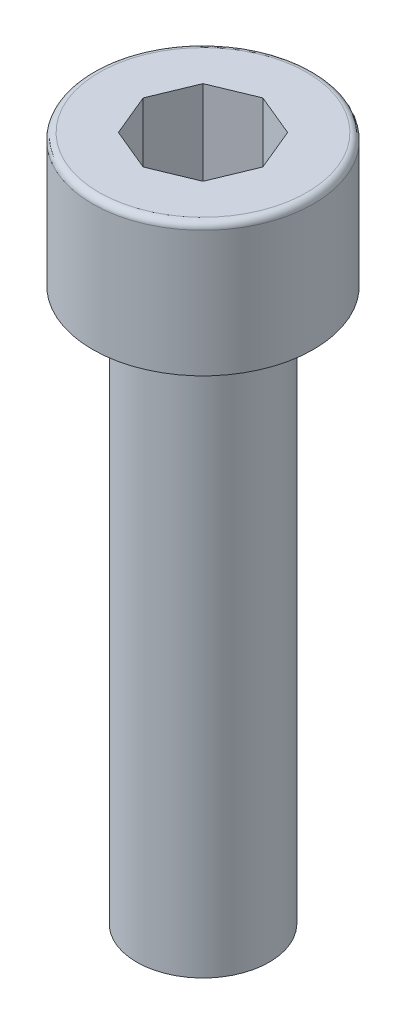
ISO-10303-21;
HEADER;
FILE_DESCRIPTION(('STEP AP214'),'2;1');
FILE_NAME('part.step','',(''),(''),'','','');
FILE_SCHEMA(('AUTOMOTIVE_DESIGN { 1 0 10303 214 1 1 1 1 }'));
ENDSEC;
DATA;
#1=APPLICATION_CONTEXT('core data for automotive mechanical design processes');
#2=APPLICATION_PROTOCOL_DEFINITION('international standard','automotive_design',2000,#1);
#3=PRODUCT_CONTEXT('',#1,'mechanical');
#4=PRODUCT('Part','Part','',(#3));
#5=PRODUCT_RELATED_PRODUCT_CATEGORY('part','',(#4));
#6=PRODUCT_DEFINITION_FORMATION('','',#4);
#7=PRODUCT_DEFINITION_CONTEXT('part definition',#1,'design');
#8=PRODUCT_DEFINITION('design','',#6,#7);
#9=PRODUCT_DEFINITION_SHAPE('','',#8);
#10=(LENGTH_UNIT() NAMED_UNIT(*) SI_UNIT(.MILLI.,.METRE.));
#11=(NAMED_UNIT(*) PLANE_ANGLE_UNIT() SI_UNIT($,.RADIAN.));
#12=(NAMED_UNIT(*) SI_UNIT($,.STERADIAN.) SOLID_ANGLE_UNIT());
#13=UNCERTAINTY_MEASURE_WITH_UNIT(LENGTH_MEASURE(1.E-05),#10,'distance_accuracy_value','');
#14=(GEOMETRIC_REPRESENTATION_CONTEXT(3) GLOBAL_UNCERTAINTY_ASSIGNED_CONTEXT((#13)) GLOBAL_UNIT_ASSIGNED_CONTEXT((#10,
#11,#12)) REPRESENTATION_CONTEXT('',''));
#15=CARTESIAN_POINT('',(0.,0.,0.));
#16=DIRECTION('',(0.,0.,1.));
#17=DIRECTION('',(1.,0.,0.));
#18=AXIS2_PLACEMENT_3D('',#15,#16,#17);
#19=CARTESIAN_POINT('',(0.,25.,0.));
#20=DIRECTION('',(0.,-1.,0.));
#21=DIRECTION('',(0.,0.,-1.));
#22=AXIS2_PLACEMENT_3D('',#19,#20,#21);
#23=CYLINDRICAL_SURFACE('',#22,3.);
#24=CARTESIAN_POINT('',(0.,24.75,0.));
#25=DIRECTION('',(0.,1.,0.));
#26=DIRECTION('',(0.,0.,1.));
#27=AXIS2_PLACEMENT_3D('',#24,#25,#26);
#28=CIRCLE('',#27,3.);
#29=CARTESIAN_POINT('',(0.,24.75,3.));
#30=VERTEX_POINT('',#29);
#31=EDGE_CURVE('E11',#30,#30,#28,.F.);
#32=ORIENTED_EDGE('',*,*,#31,.T.);
#33=EDGE_LOOP('',(#32));
#34=FACE_BOUND('',#33,.T.);
#35=CARTESIAN_POINT('',(0.,0.,0.));
#36=DIRECTION('',(0.,1.,0.));
#37=DIRECTION('',(0.,0.,1.));
#38=AXIS2_PLACEMENT_3D('',#35,#36,#37);
#39=CIRCLE('',#38,3.);
#40=CARTESIAN_POINT('',(0.,0.,3.));
#41=VERTEX_POINT('',#40);
#42=EDGE_CURVE('E110',#41,#41,#39,.T.);
#43=ORIENTED_EDGE('',*,*,#42,.T.);
#44=EDGE_LOOP('',(#43));
#45=FACE_BOUND('',#44,.T.);
#46=ADVANCED_FACE('F37',(#34,#45),#23,.T.);
#47=CARTESIAN_POINT('',(0.,0.,0.));
#48=DIRECTION('',(0.,1.,0.));
#49=DIRECTION('',(0.,0.,1.));
#50=AXIS2_PLACEMENT_3D('',#47,#48,#49);
#51=PLANE('',#50);
#52=ORIENTED_EDGE('',*,*,#42,.F.);
#53=EDGE_LOOP('',(#52));
#54=FACE_BOUND('',#53,.T.);
#55=ADVANCED_FACE('F198',(#54),#51,.F.);
#56=CARTESIAN_POINT('',(2.30969883127822,31.,0.956708580912724));
#57=DIRECTION('',(-0.923879532511287,0.,-0.38268343236509));
#58=DIRECTION('',(-0.38268343236509,0.,0.923879532511287));
#59=AXIS2_PLACEMENT_3D('',#56,#57,#58);
#60=PLANE('',#59);
#61=DIRECTION('',(0.38268343236509,0.,-0.923879532511287));
#62=VECTOR('',#61,1.);
#63=CARTESIAN_POINT('',(2.30969883127822,25.,0.956708580912724));
#64=LINE('',#63,#62);
#65=CARTESIAN_POINT('',(1.91341716182545,25.,1.91341716182545));
#66=VERTEX_POINT('',#65);
#67=CARTESIAN_POINT('',(2.70598050073098,25.,0.));
#68=VERTEX_POINT('',#67);
#69=EDGE_CURVE('E107',#66,#68,#64,.T.);
#70=ORIENTED_EDGE('',*,*,#69,.F.);
#71=DIRECTION('',(0.,-1.,0.));
#72=VECTOR('',#71,1.);
#73=CARTESIAN_POINT('',(1.91341716182545,31.,1.91341716182545));
#74=LINE('',#73,#72);
#75=CARTESIAN_POINT('',(1.91341716182545,31.,1.91341716182545));
#76=VERTEX_POINT('',#75);
#77=EDGE_CURVE('E101',#76,#66,#74,.T.);
#78=ORIENTED_EDGE('',*,*,#77,.F.);
#79=DIRECTION('',(0.38268343236509,0.,-0.923879532511287));
#80=VECTOR('',#79,1.);
#81=CARTESIAN_POINT('',(2.30969883127822,31.,0.956708580912724));
#82=LINE('',#81,#80);
#83=CARTESIAN_POINT('',(2.70598050073098,31.,0.));
#84=VERTEX_POINT('',#83);
#85=EDGE_CURVE('E105',#76,#84,#82,.T.);
#86=ORIENTED_EDGE('',*,*,#85,.T.);
#87=DIRECTION('',(0.,-1.,0.));
#88=VECTOR('',#87,1.);
#89=CARTESIAN_POINT('',(2.70598050073098,31.,0.));
#90=LINE('',#89,#88);
#91=EDGE_CURVE('E142',#84,#68,#90,.T.);
#92=ORIENTED_EDGE('',*,*,#91,.T.);
#93=EDGE_LOOP('',(#70,#78,#86,#92));
#94=FACE_BOUND('',#93,.T.);
#95=ADVANCED_FACE('F103',(#94),#60,.T.);
#96=CARTESIAN_POINT('',(0.956708580912724,31.,2.30969883127822));
#97=DIRECTION('',(-0.38268343236509,0.,-0.923879532511287));
#98=DIRECTION('',(-0.923879532511287,0.,0.38268343236509));
#99=AXIS2_PLACEMENT_3D('',#96,#97,#98);
#100=PLANE('',#99);
#101=DIRECTION('',(0.923879532511287,0.,-0.38268343236509));
#102=VECTOR('',#101,1.);
#103=CARTESIAN_POINT('',(0.956708580912724,25.,2.30969883127822));
#104=LINE('',#103,#102);
#105=CARTESIAN_POINT('',(0.,25.,2.70598050073098));
#106=VERTEX_POINT('',#105);
#107=EDGE_CURVE('E52',#106,#66,#104,.T.);
#108=ORIENTED_EDGE('',*,*,#107,.F.);
#109=DIRECTION('',(0.,-1.,0.));
#110=VECTOR('',#109,1.);
#111=CARTESIAN_POINT('',(0.,31.,2.70598050073098));
#112=LINE('',#111,#110);
#113=CARTESIAN_POINT('',(0.,31.,2.70598050073098));
#114=VERTEX_POINT('',#113);
#115=EDGE_CURVE('E111',#114,#106,#112,.T.);
#116=ORIENTED_EDGE('',*,*,#115,.F.);
#117=DIRECTION('',(0.923879532511287,0.,-0.38268343236509));
#118=VECTOR('',#117,1.);
#119=CARTESIAN_POINT('',(0.956708580912724,31.,2.30969883127822));
#120=LINE('',#119,#118);
#121=EDGE_CURVE('E117',#114,#76,#120,.T.);
#122=ORIENTED_EDGE('',*,*,#121,.T.);
#123=ORIENTED_EDGE('',*,*,#77,.T.);
#124=EDGE_LOOP('',(#108,#116,#122,#123));
#125=FACE_BOUND('',#124,.T.);
#126=ADVANCED_FACE('F124',(#125),#100,.T.);
#127=CARTESIAN_POINT('',(-0.956708580912724,31.,2.30969883127822));
#128=DIRECTION('',(0.38268343236509,0.,-0.923879532511287));
#129=DIRECTION('',(-0.923879532511287,0.,-0.38268343236509));
#130=AXIS2_PLACEMENT_3D('',#127,#128,#129);
#131=PLANE('',#130);
#132=DIRECTION('',(0.923879532511287,0.,0.38268343236509));
#133=VECTOR('',#132,1.);
#134=CARTESIAN_POINT('',(-0.956708580912724,25.,2.30969883127822));
#135=LINE('',#134,#133);
#136=CARTESIAN_POINT('',(-1.91341716182545,25.,1.91341716182545));
#137=VERTEX_POINT('',#136);
#138=EDGE_CURVE('E57',#137,#106,#135,.T.);
#139=ORIENTED_EDGE('',*,*,#138,.F.);
#140=DIRECTION('',(0.,-1.,0.));
#141=VECTOR('',#140,1.);
#142=CARTESIAN_POINT('',(-1.91341716182545,31.,1.91341716182545));
#143=LINE('',#142,#141);
#144=CARTESIAN_POINT('',(-1.91341716182545,31.,1.91341716182545));
#145=VERTEX_POINT('',#144);
#146=EDGE_CURVE('E171',#145,#137,#143,.T.);
#147=ORIENTED_EDGE('',*,*,#146,.F.);
#148=DIRECTION('',(0.923879532511287,0.,0.38268343236509));
#149=VECTOR('',#148,1.);
#150=CARTESIAN_POINT('',(-0.956708580912724,31.,2.30969883127822));
#151=LINE('',#150,#149);
#152=EDGE_CURVE('E125',#145,#114,#151,.T.);
#153=ORIENTED_EDGE('',*,*,#152,.T.);
#154=ORIENTED_EDGE('',*,*,#115,.T.);
#155=EDGE_LOOP('',(#139,#147,#153,#154));
#156=FACE_BOUND('',#155,.T.);
#157=ADVANCED_FACE('F220',(#156),#131,.T.);
#158=CARTESIAN_POINT('',(-2.30969883127822,31.,0.956708580912725));
#159=DIRECTION('',(0.923879532511287,0.,-0.38268343236509));
#160=DIRECTION('',(-0.38268343236509,0.,-0.923879532511287));
#161=AXIS2_PLACEMENT_3D('',#158,#159,#160);
#162=PLANE('',#161);
#163=DIRECTION('',(0.38268343236509,0.,0.923879532511287));
#164=VECTOR('',#163,1.);
#165=CARTESIAN_POINT('',(-2.30969883127822,25.,0.956708580912725));
#166=LINE('',#165,#164);
#167=CARTESIAN_POINT('',(-2.70598050073099,25.,0.));
#168=VERTEX_POINT('',#167);
#169=EDGE_CURVE('E149',#168,#137,#166,.T.);
#170=ORIENTED_EDGE('',*,*,#169,.F.);
#171=DIRECTION('',(0.,-1.,0.));
#172=VECTOR('',#171,1.);
#173=CARTESIAN_POINT('',(-2.70598050073099,31.,0.));
#174=LINE('',#173,#172);
#175=CARTESIAN_POINT('',(-2.70598050073099,31.,0.));
#176=VERTEX_POINT('',#175);
#177=EDGE_CURVE('E168',#176,#168,#174,.T.);
#178=ORIENTED_EDGE('',*,*,#177,.F.);
#179=DIRECTION('',(0.38268343236509,0.,0.923879532511287));
#180=VECTOR('',#179,1.);
#181=CARTESIAN_POINT('',(-2.30969883127822,31.,0.956708580912725));
#182=LINE('',#181,#180);
#183=EDGE_CURVE('E127',#176,#145,#182,.T.);
#184=ORIENTED_EDGE('',*,*,#183,.T.);
#185=ORIENTED_EDGE('',*,*,#146,.T.);
#186=EDGE_LOOP('',(#170,#178,#184,#185));
#187=FACE_BOUND('',#186,.T.);
#188=ADVANCED_FACE('F223',(#187),#162,.T.);
#189=CARTESIAN_POINT('',(-2.30969883127822,31.,-0.956708580912724));
#190=DIRECTION('',(0.923879532511287,0.,0.382683432365089));
#191=DIRECTION('',(0.382683432365089,0.,-0.923879532511287));
#192=AXIS2_PLACEMENT_3D('',#189,#190,#191);
#193=PLANE('',#192);
#194=DIRECTION('',(-0.382683432365089,0.,0.923879532511287));
#195=VECTOR('',#194,1.);
#196=CARTESIAN_POINT('',(-2.30969883127822,25.,-0.956708580912724));
#197=LINE('',#196,#195);
#198=CARTESIAN_POINT('',(-1.91341716182545,25.,-1.91341716182545));
#199=VERTEX_POINT('',#198);
#200=EDGE_CURVE('E151',#199,#168,#197,.T.);
#201=ORIENTED_EDGE('',*,*,#200,.F.);
#202=DIRECTION('',(0.,-1.,0.));
#203=VECTOR('',#202,1.);
#204=CARTESIAN_POINT('',(-1.91341716182545,31.,-1.91341716182545));
#205=LINE('',#204,#203);
#206=CARTESIAN_POINT('',(-1.91341716182545,31.,-1.91341716182545));
#207=VERTEX_POINT('',#206);
#208=EDGE_CURVE('E165',#207,#199,#205,.T.);
#209=ORIENTED_EDGE('',*,*,#208,.F.);
#210=DIRECTION('',(-0.382683432365089,0.,0.923879532511287));
#211=VECTOR('',#210,1.);
#212=CARTESIAN_POINT('',(-2.30969883127822,31.,-0.956708580912724));
#213=LINE('',#212,#211);
#214=EDGE_CURVE('E132',#207,#176,#213,.T.);
#215=ORIENTED_EDGE('',*,*,#214,.T.);
#216=ORIENTED_EDGE('',*,*,#177,.T.);
#217=EDGE_LOOP('',(#201,#209,#215,#216));
#218=FACE_BOUND('',#217,.T.);
#219=ADVANCED_FACE('F227',(#218),#193,.T.);
#220=CARTESIAN_POINT('',(-0.95670858091274,31.,-2.30969883127822));
#221=DIRECTION('',(0.382683432365095,0.,0.923879532511285));
#222=DIRECTION('',(0.923879532511285,0.,-0.382683432365095));
#223=AXIS2_PLACEMENT_3D('',#220,#221,#222);
#224=PLANE('',#223);
#225=DIRECTION('',(-0.923879532511285,0.,0.382683432365095));
#226=VECTOR('',#225,1.);
#227=CARTESIAN_POINT('',(-0.95670858091274,25.,-2.30969883127822));
#228=LINE('',#227,#226);
#229=CARTESIAN_POINT('',(0.,25.,-2.70598050073098));
#230=VERTEX_POINT('',#229);
#231=EDGE_CURVE('E153',#230,#199,#228,.T.);
#232=ORIENTED_EDGE('',*,*,#231,.F.);
#233=DIRECTION('',(0.,-1.,0.));
#234=VECTOR('',#233,1.);
#235=CARTESIAN_POINT('',(0.,31.,-2.70598050073098));
#236=LINE('',#235,#234);
#237=CARTESIAN_POINT('',(0.,31.,-2.70598050073098));
#238=VERTEX_POINT('',#237);
#239=EDGE_CURVE('E162',#238,#230,#236,.T.);
#240=ORIENTED_EDGE('',*,*,#239,.F.);
#241=DIRECTION('',(-0.923879532511285,0.,0.382683432365095));
#242=VECTOR('',#241,1.);
#243=CARTESIAN_POINT('',(-0.95670858091274,31.,-2.30969883127822));
#244=LINE('',#243,#242);
#245=EDGE_CURVE('E135',#238,#207,#244,.T.);
#246=ORIENTED_EDGE('',*,*,#245,.T.);
#247=ORIENTED_EDGE('',*,*,#208,.T.);
#248=EDGE_LOOP('',(#232,#240,#246,#247));
#249=FACE_BOUND('',#248,.T.);
#250=ADVANCED_FACE('F231',(#249),#224,.T.);
#251=CARTESIAN_POINT('',(0.956708580912708,31.,-2.30969883127822));
#252=DIRECTION('',(-0.382683432365084,0.,0.923879532511289));
#253=DIRECTION('',(0.923879532511289,0.,0.382683432365084));
#254=AXIS2_PLACEMENT_3D('',#251,#252,#253);
#255=PLANE('',#254);
#256=DIRECTION('',(-0.923879532511289,0.,-0.382683432365084));
#257=VECTOR('',#256,1.);
#258=CARTESIAN_POINT('',(0.956708580912708,25.,-2.30969883127822));
#259=LINE('',#258,#257);
#260=CARTESIAN_POINT('',(1.91341716182545,25.,-1.91341716182545));
#261=VERTEX_POINT('',#260);
#262=EDGE_CURVE('E155',#261,#230,#259,.T.);
#263=ORIENTED_EDGE('',*,*,#262,.F.);
#264=DIRECTION('',(0.,-1.,0.));
#265=VECTOR('',#264,1.);
#266=CARTESIAN_POINT('',(1.91341716182545,31.,-1.91341716182545));
#267=LINE('',#266,#265);
#268=CARTESIAN_POINT('',(1.91341716182545,31.,-1.91341716182545));
#269=VERTEX_POINT('',#268);
#270=EDGE_CURVE('E159',#269,#261,#267,.T.);
#271=ORIENTED_EDGE('',*,*,#270,.F.);
#272=DIRECTION('',(-0.923879532511289,0.,-0.382683432365084));
#273=VECTOR('',#272,1.);
#274=CARTESIAN_POINT('',(0.956708580912708,31.,-2.30969883127822));
#275=LINE('',#274,#273);
#276=EDGE_CURVE('E138',#269,#238,#275,.T.);
#277=ORIENTED_EDGE('',*,*,#276,.T.);
#278=ORIENTED_EDGE('',*,*,#239,.T.);
#279=EDGE_LOOP('',(#263,#271,#277,#278));
#280=FACE_BOUND('',#279,.T.);
#281=ADVANCED_FACE('F214',(#280),#255,.T.);
#282=CARTESIAN_POINT('',(0.,31.,0.));
#283=DIRECTION('',(0.,-1.,0.));
#284=DIRECTION('',(0.,0.,-1.));
#285=AXIS2_PLACEMENT_3D('',#282,#283,#284);
#286=CYLINDRICAL_SURFACE('',#285,5.);
#287=CARTESIAN_POINT('',(0.,30.7,0.));
#288=DIRECTION('',(0.,1.,0.));
#289=DIRECTION('',(0.,0.,1.));
#290=AXIS2_PLACEMENT_3D('',#287,#288,#289);
#291=CIRCLE('',#290,5.);
#292=CARTESIAN_POINT('',(0.,30.7,5.));
#293=VERTEX_POINT('',#292);
#294=EDGE_CURVE('E180',#293,#293,#291,.F.);
#295=ORIENTED_EDGE('',*,*,#294,.T.);
#296=EDGE_LOOP('',(#295));
#297=FACE_BOUND('',#296,.T.);
#298=CARTESIAN_POINT('',(0.,25.,0.));
#299=DIRECTION('',(0.,1.,0.));
#300=DIRECTION('',(0.,0.,1.));
#301=AXIS2_PLACEMENT_3D('',#298,#299,#300);
#302=CIRCLE('',#301,5.);
#303=CARTESIAN_POINT('',(0.,25.,5.));
#304=VERTEX_POINT('',#303);
#305=EDGE_CURVE('E143',#304,#304,#302,.T.);
#306=ORIENTED_EDGE('',*,*,#305,.T.);
#307=EDGE_LOOP('',(#306));
#308=FACE_BOUND('',#307,.T.);
#309=ADVANCED_FACE('F210',(#297,#308),#286,.T.);
#310=CARTESIAN_POINT('',(2.30969883127822,31.,-0.956708580912725));
#311=DIRECTION('',(-0.923879532511287,0.,0.38268343236509));
#312=DIRECTION('',(0.38268343236509,0.,0.923879532511287));
#313=AXIS2_PLACEMENT_3D('',#310,#311,#312);
#314=PLANE('',#313);
#315=DIRECTION('',(-0.38268343236509,0.,-0.923879532511287));
#316=VECTOR('',#315,1.);
#317=CARTESIAN_POINT('',(2.30969883127822,25.,-0.956708580912725));
#318=LINE('',#317,#316);
#319=EDGE_CURVE('E122',#68,#261,#318,.T.);
#320=ORIENTED_EDGE('',*,*,#319,.F.);
#321=ORIENTED_EDGE('',*,*,#91,.F.);
#322=DIRECTION('',(-0.38268343236509,0.,-0.923879532511287));
#323=VECTOR('',#322,1.);
#324=CARTESIAN_POINT('',(2.30969883127822,31.,-0.956708580912725));
#325=LINE('',#324,#323);
#326=EDGE_CURVE('E121',#84,#269,#325,.T.);
#327=ORIENTED_EDGE('',*,*,#326,.T.);
#328=ORIENTED_EDGE('',*,*,#270,.T.);
#329=EDGE_LOOP('',(#320,#321,#327,#328));
#330=FACE_BOUND('',#329,.T.);
#331=ADVANCED_FACE('F213',(#330),#314,.T.);
#332=CARTESIAN_POINT('',(0.,31.,0.));
#333=DIRECTION('',(0.,1.,0.));
#334=DIRECTION('',(0.,0.,1.));
#335=AXIS2_PLACEMENT_3D('',#332,#333,#334);
#336=PLANE('',#335);
#337=CARTESIAN_POINT('',(0.,31.,0.));
#338=DIRECTION('',(0.,1.,0.));
#339=DIRECTION('',(0.,0.,1.));
#340=AXIS2_PLACEMENT_3D('',#337,#338,#339);
#341=CIRCLE('',#340,4.7);
#342=CARTESIAN_POINT('',(0.,31.,4.7));
#343=VERTEX_POINT('',#342);
#344=EDGE_CURVE('E177',#343,#343,#341,.T.);
#345=ORIENTED_EDGE('',*,*,#344,.T.);
#346=EDGE_LOOP('',(#345));
#347=FACE_BOUND('',#346,.T.);
#348=ORIENTED_EDGE('',*,*,#85,.F.);
#349=ORIENTED_EDGE('',*,*,#121,.F.);
#350=ORIENTED_EDGE('',*,*,#152,.F.);
#351=ORIENTED_EDGE('',*,*,#183,.F.);
#352=ORIENTED_EDGE('',*,*,#214,.F.);
#353=ORIENTED_EDGE('',*,*,#245,.F.);
#354=ORIENTED_EDGE('',*,*,#276,.F.);
#355=ORIENTED_EDGE('',*,*,#326,.F.);
#356=EDGE_LOOP('',(#348,#349,#350,#351,#352,#353,#354,#355));
#357=FACE_BOUND('',#356,.T.);
#358=ADVANCED_FACE('F115',(#347,#357),#336,.T.);
#359=CARTESIAN_POINT('',(0.,25.,0.));
#360=DIRECTION('',(0.,1.,0.));
#361=DIRECTION('',(0.,0.,1.));
#362=AXIS2_PLACEMENT_3D('',#359,#360,#361);
#363=PLANE('',#362);
#364=CARTESIAN_POINT('',(0.,25.,0.));
#365=DIRECTION('',(0.,1.,0.));
#366=DIRECTION('',(0.,0.,1.));
#367=AXIS2_PLACEMENT_3D('',#364,#365,#366);
#368=CIRCLE('',#367,3.25);
#369=CARTESIAN_POINT('',(0.,25.,3.25));
#370=VERTEX_POINT('',#369);
#371=EDGE_CURVE('E45',#370,#370,#368,.T.);
#372=ORIENTED_EDGE('',*,*,#371,.T.);
#373=EDGE_LOOP('',(#372));
#374=FACE_BOUND('',#373,.T.);
#375=ORIENTED_EDGE('',*,*,#305,.F.);
#376=EDGE_LOOP('',(#375));
#377=FACE_BOUND('',#376,.T.);
#378=ADVANCED_FACE('F185',(#374,#377),#363,.F.);
#379=CARTESIAN_POINT('',(0.,25.,0.));
#380=DIRECTION('',(0.,1.,0.));
#381=DIRECTION('',(0.,0.,1.));
#382=AXIS2_PLACEMENT_3D('',#379,#380,#381);
#383=PLANE('',#382);
#384=ORIENTED_EDGE('',*,*,#69,.T.);
#385=ORIENTED_EDGE('',*,*,#319,.T.);
#386=ORIENTED_EDGE('',*,*,#262,.T.);
#387=ORIENTED_EDGE('',*,*,#231,.T.);
#388=ORIENTED_EDGE('',*,*,#200,.T.);
#389=ORIENTED_EDGE('',*,*,#169,.T.);
#390=ORIENTED_EDGE('',*,*,#138,.T.);
#391=ORIENTED_EDGE('',*,*,#107,.T.);
#392=EDGE_LOOP('',(#384,#385,#386,#387,#388,#389,#390,#391));
#393=FACE_BOUND('',#392,.T.);
#394=ADVANCED_FACE('F194',(#393),#383,.T.);
#395=CARTESIAN_POINT('',(0.,30.7,0.));
#396=DIRECTION('',(0.,1.,0.));
#397=DIRECTION('',(0.,0.,1.));
#398=AXIS2_PLACEMENT_3D('',#395,#396,#397);
#399=TOROIDAL_SURFACE('',#398,4.7,0.3);
#400=ORIENTED_EDGE('',*,*,#294,.F.);
#401=EDGE_LOOP('',(#400));
#402=FACE_BOUND('',#401,.T.);
#403=ORIENTED_EDGE('',*,*,#344,.F.);
#404=EDGE_LOOP('',(#403));
#405=FACE_BOUND('',#404,.T.);
#406=ADVANCED_FACE('F189',(#402,#405),#399,.T.);
#407=CARTESIAN_POINT('',(0.,24.75,0.));
#408=DIRECTION('',(0.,1.,0.));
#409=DIRECTION('',(0.,0.,1.));
#410=AXIS2_PLACEMENT_3D('',#407,#408,#409);
#411=TOROIDAL_SURFACE('',#410,3.25,0.25);
#412=ORIENTED_EDGE('',*,*,#31,.F.);
#413=EDGE_LOOP('',(#412));
#414=FACE_BOUND('',#413,.T.);
#415=ORIENTED_EDGE('',*,*,#371,.F.);
#416=EDGE_LOOP('',(#415));
#417=FACE_BOUND('',#416,.T.);
#418=ADVANCED_FACE('F39',(#414,#417),#411,.F.);
#419=CLOSED_SHELL('',(#46,#55,#95,#126,#157,#188,#219,#250,#281,#309,#331,#358,#378,#394,#406,#418));
#420=MANIFOLD_SOLID_BREP('B2',#419);
#421=ADVANCED_BREP_SHAPE_REPRESENTATION('',(#18,#420),#14);
#422=SHAPE_DEFINITION_REPRESENTATION(#9,#421);
ENDSEC;
END-ISO-10303-21;
